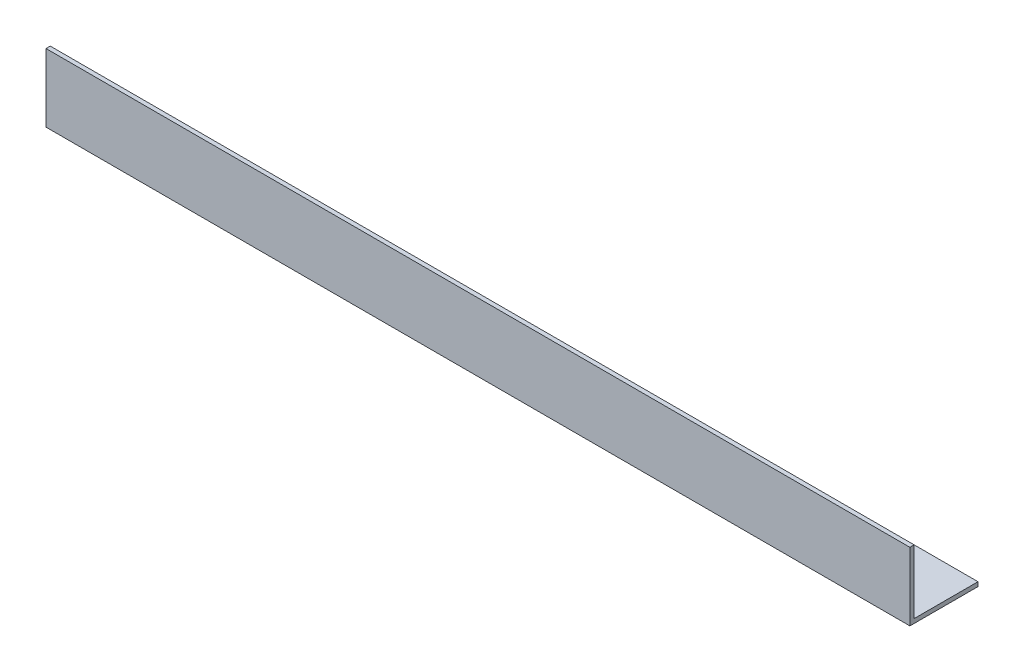
ISO-10303-21;
HEADER;
FILE_DESCRIPTION(('STEP AP214'),'2;1');
FILE_NAME('part.step','',(''),(''),'','','');
FILE_SCHEMA(('AUTOMOTIVE_DESIGN { 1 0 10303 214 1 1 1 1 }'));
ENDSEC;
DATA;
#1=APPLICATION_CONTEXT('core data for automotive mechanical design processes');
#2=APPLICATION_PROTOCOL_DEFINITION('international standard','automotive_design',2000,#1);
#3=PRODUCT_CONTEXT('',#1,'mechanical');
#4=PRODUCT('Part','Part','',(#3));
#5=PRODUCT_RELATED_PRODUCT_CATEGORY('part','',(#4));
#6=PRODUCT_DEFINITION_FORMATION('','',#4);
#7=PRODUCT_DEFINITION_CONTEXT('part definition',#1,'design');
#8=PRODUCT_DEFINITION('design','',#6,#7);
#9=PRODUCT_DEFINITION_SHAPE('','',#8);
#10=(LENGTH_UNIT() NAMED_UNIT(*) SI_UNIT(.MILLI.,.METRE.));
#11=(NAMED_UNIT(*) PLANE_ANGLE_UNIT() SI_UNIT($,.RADIAN.));
#12=(NAMED_UNIT(*) SI_UNIT($,.STERADIAN.) SOLID_ANGLE_UNIT());
#13=UNCERTAINTY_MEASURE_WITH_UNIT(LENGTH_MEASURE(1.E-05),#10,'distance_accuracy_value','');
#14=(GEOMETRIC_REPRESENTATION_CONTEXT(3) GLOBAL_UNCERTAINTY_ASSIGNED_CONTEXT((#13)) GLOBAL_UNIT_ASSIGNED_CONTEXT((#10,
#11,#12)) REPRESENTATION_CONTEXT('',''));
#15=CARTESIAN_POINT('',(0.,0.,0.));
#16=DIRECTION('',(0.,0.,1.));
#17=DIRECTION('',(1.,0.,0.));
#18=AXIS2_PLACEMENT_3D('',#15,#16,#17);
#19=CARTESIAN_POINT('',(203.,16.,-0.999999999999999));
#20=DIRECTION('',(0.,-1.,0.));
#21=DIRECTION('',(0.,0.,-1.));
#22=AXIS2_PLACEMENT_3D('',#19,#20,#21);
#23=PLANE('',#22);
#24=DIRECTION('',(0.,0.,1.));
#25=VECTOR('',#24,1.);
#26=CARTESIAN_POINT('',(0.,16.,-0.999999999999999));
#27=LINE('',#26,#25);
#28=CARTESIAN_POINT('',(0.,16.,-0.999999999999999));
#29=VERTEX_POINT('',#28);
#30=CARTESIAN_POINT('',(0.,16.,0.));
#31=VERTEX_POINT('',#30);
#32=EDGE_CURVE('E116',#29,#31,#27,.T.);
#33=ORIENTED_EDGE('',*,*,#32,.T.);
#34=DIRECTION('',(-1.,0.,0.));
#35=VECTOR('',#34,1.);
#36=CARTESIAN_POINT('',(203.,16.,0.));
#37=LINE('',#36,#35);
#38=CARTESIAN_POINT('',(203.,16.,0.));
#39=VERTEX_POINT('',#38);
#40=EDGE_CURVE('E11',#39,#31,#37,.T.);
#41=ORIENTED_EDGE('',*,*,#40,.F.);
#42=DIRECTION('',(0.,0.,1.));
#43=VECTOR('',#42,1.);
#44=CARTESIAN_POINT('',(203.,16.,-0.999999999999999));
#45=LINE('',#44,#43);
#46=CARTESIAN_POINT('',(203.,16.,-0.999999999999999));
#47=VERTEX_POINT('',#46);
#48=EDGE_CURVE('E126',#47,#39,#45,.T.);
#49=ORIENTED_EDGE('',*,*,#48,.F.);
#50=DIRECTION('',(-1.,0.,0.));
#51=VECTOR('',#50,1.);
#52=CARTESIAN_POINT('',(203.,16.,-0.999999999999999));
#53=LINE('',#52,#51);
#54=EDGE_CURVE('E112',#47,#29,#53,.T.);
#55=ORIENTED_EDGE('',*,*,#54,.T.);
#56=EDGE_LOOP('',(#33,#41,#49,#55));
#57=FACE_BOUND('',#56,.T.);
#58=ADVANCED_FACE('F32',(#57),#23,.F.);
#59=CARTESIAN_POINT('',(203.,16.,0.));
#60=DIRECTION('',(0.,0.,-1.));
#61=DIRECTION('',(0.,1.,0.));
#62=AXIS2_PLACEMENT_3D('',#59,#60,#61);
#63=PLANE('',#62);
#64=DIRECTION('',(0.,-1.,0.));
#65=VECTOR('',#64,1.);
#66=CARTESIAN_POINT('',(0.,16.,0.));
#67=LINE('',#66,#65);
#68=CARTESIAN_POINT('',(0.,0.,0.));
#69=VERTEX_POINT('',#68);
#70=EDGE_CURVE('E119',#31,#69,#67,.T.);
#71=ORIENTED_EDGE('',*,*,#70,.T.);
#72=DIRECTION('',(-1.,0.,0.));
#73=VECTOR('',#72,1.);
#74=CARTESIAN_POINT('',(203.,0.,0.));
#75=LINE('',#74,#73);
#76=CARTESIAN_POINT('',(203.,0.,0.));
#77=VERTEX_POINT('',#76);
#78=EDGE_CURVE('E40',#77,#69,#75,.T.);
#79=ORIENTED_EDGE('',*,*,#78,.F.);
#80=DIRECTION('',(0.,-1.,0.));
#81=VECTOR('',#80,1.);
#82=CARTESIAN_POINT('',(203.,16.,0.));
#83=LINE('',#82,#81);
#84=EDGE_CURVE('E85',#39,#77,#83,.T.);
#85=ORIENTED_EDGE('',*,*,#84,.F.);
#86=ORIENTED_EDGE('',*,*,#40,.T.);
#87=EDGE_LOOP('',(#71,#79,#85,#86));
#88=FACE_BOUND('',#87,.T.);
#89=ADVANCED_FACE('F150',(#88),#63,.F.);
#90=CARTESIAN_POINT('',(203.,0.,0.));
#91=DIRECTION('',(0.,1.,0.));
#92=DIRECTION('',(0.,0.,1.));
#93=AXIS2_PLACEMENT_3D('',#90,#91,#92);
#94=PLANE('',#93);
#95=DIRECTION('',(0.,0.,-1.));
#96=VECTOR('',#95,1.);
#97=CARTESIAN_POINT('',(0.,0.,0.));
#98=LINE('',#97,#96);
#99=CARTESIAN_POINT('',(0.,0.,-16.));
#100=VERTEX_POINT('',#99);
#101=EDGE_CURVE('E121',#69,#100,#98,.T.);
#102=ORIENTED_EDGE('',*,*,#101,.T.);
#103=DIRECTION('',(-1.,0.,0.));
#104=VECTOR('',#103,1.);
#105=CARTESIAN_POINT('',(203.,0.,-16.));
#106=LINE('',#105,#104);
#107=CARTESIAN_POINT('',(203.,0.,-16.));
#108=VERTEX_POINT('',#107);
#109=EDGE_CURVE('E107',#108,#100,#106,.T.);
#110=ORIENTED_EDGE('',*,*,#109,.F.);
#111=DIRECTION('',(0.,0.,-1.));
#112=VECTOR('',#111,1.);
#113=CARTESIAN_POINT('',(203.,0.,0.));
#114=LINE('',#113,#112);
#115=EDGE_CURVE('E98',#77,#108,#114,.T.);
#116=ORIENTED_EDGE('',*,*,#115,.F.);
#117=ORIENTED_EDGE('',*,*,#78,.T.);
#118=EDGE_LOOP('',(#102,#110,#116,#117));
#119=FACE_BOUND('',#118,.T.);
#120=ADVANCED_FACE('F132',(#119),#94,.F.);
#121=CARTESIAN_POINT('',(203.,0.,-16.));
#122=DIRECTION('',(0.,0.,1.));
#123=DIRECTION('',(1.,0.,0.));
#124=AXIS2_PLACEMENT_3D('',#121,#122,#123);
#125=PLANE('',#124);
#126=DIRECTION('',(0.,1.,0.));
#127=VECTOR('',#126,1.);
#128=CARTESIAN_POINT('',(0.,0.,-16.));
#129=LINE('',#128,#127);
#130=CARTESIAN_POINT('',(0.,1.,-16.));
#131=VERTEX_POINT('',#130);
#132=EDGE_CURVE('E106',#100,#131,#129,.T.);
#133=ORIENTED_EDGE('',*,*,#132,.T.);
#134=DIRECTION('',(-1.,0.,0.));
#135=VECTOR('',#134,1.);
#136=CARTESIAN_POINT('',(203.,1.,-16.));
#137=LINE('',#136,#135);
#138=CARTESIAN_POINT('',(203.,1.,-16.));
#139=VERTEX_POINT('',#138);
#140=EDGE_CURVE('E103',#139,#131,#137,.T.);
#141=ORIENTED_EDGE('',*,*,#140,.F.);
#142=DIRECTION('',(0.,1.,0.));
#143=VECTOR('',#142,1.);
#144=CARTESIAN_POINT('',(203.,0.,-16.));
#145=LINE('',#144,#143);
#146=EDGE_CURVE('E92',#108,#139,#145,.T.);
#147=ORIENTED_EDGE('',*,*,#146,.F.);
#148=ORIENTED_EDGE('',*,*,#109,.T.);
#149=EDGE_LOOP('',(#133,#141,#147,#148));
#150=FACE_BOUND('',#149,.T.);
#151=ADVANCED_FACE('F104',(#150),#125,.F.);
#152=CARTESIAN_POINT('',(203.,1.,-16.));
#153=DIRECTION('',(0.,-1.,0.));
#154=DIRECTION('',(0.,0.,-1.));
#155=AXIS2_PLACEMENT_3D('',#152,#153,#154);
#156=PLANE('',#155);
#157=DIRECTION('',(0.,0.,1.));
#158=VECTOR('',#157,1.);
#159=CARTESIAN_POINT('',(0.,1.,-16.));
#160=LINE('',#159,#158);
#161=CARTESIAN_POINT('',(0.,0.999999999999998,-1.));
#162=VERTEX_POINT('',#161);
#163=EDGE_CURVE('E71',#131,#162,#160,.T.);
#164=ORIENTED_EDGE('',*,*,#163,.T.);
#165=DIRECTION('',(-1.,0.,0.));
#166=VECTOR('',#165,1.);
#167=CARTESIAN_POINT('',(203.,0.999999999999998,-1.));
#168=LINE('',#167,#166);
#169=CARTESIAN_POINT('',(203.,0.999999999999998,-1.));
#170=VERTEX_POINT('',#169);
#171=EDGE_CURVE('E108',#170,#162,#168,.T.);
#172=ORIENTED_EDGE('',*,*,#171,.F.);
#173=DIRECTION('',(0.,0.,1.));
#174=VECTOR('',#173,1.);
#175=CARTESIAN_POINT('',(203.,1.,-16.));
#176=LINE('',#175,#174);
#177=EDGE_CURVE('E96',#139,#170,#176,.T.);
#178=ORIENTED_EDGE('',*,*,#177,.F.);
#179=ORIENTED_EDGE('',*,*,#140,.T.);
#180=EDGE_LOOP('',(#164,#172,#178,#179));
#181=FACE_BOUND('',#180,.T.);
#182=ADVANCED_FACE('F110',(#181),#156,.F.);
#183=CARTESIAN_POINT('',(203.,0.999999999999998,-1.));
#184=DIRECTION('',(0.,0.,1.));
#185=DIRECTION('',(0.,-1.,0.));
#186=AXIS2_PLACEMENT_3D('',#183,#184,#185);
#187=PLANE('',#186);
#188=DIRECTION('',(0.,1.,0.));
#189=VECTOR('',#188,1.);
#190=CARTESIAN_POINT('',(0.,0.999999999999998,-1.));
#191=LINE('',#190,#189);
#192=EDGE_CURVE('E77',#162,#29,#191,.T.);
#193=ORIENTED_EDGE('',*,*,#192,.T.);
#194=ORIENTED_EDGE('',*,*,#54,.F.);
#195=DIRECTION('',(0.,1.,0.));
#196=VECTOR('',#195,1.);
#197=CARTESIAN_POINT('',(203.,0.999999999999998,-1.));
#198=LINE('',#197,#196);
#199=EDGE_CURVE('E48',#170,#47,#198,.T.);
#200=ORIENTED_EDGE('',*,*,#199,.F.);
#201=ORIENTED_EDGE('',*,*,#171,.T.);
#202=EDGE_LOOP('',(#193,#194,#200,#201));
#203=FACE_BOUND('',#202,.T.);
#204=ADVANCED_FACE('F139',(#203),#187,.F.);
#205=CARTESIAN_POINT('',(203.,0.,0.));
#206=DIRECTION('',(1.,0.,0.));
#207=DIRECTION('',(0.,0.,-1.));
#208=AXIS2_PLACEMENT_3D('',#205,#206,#207);
#209=PLANE('',#208);
#210=ORIENTED_EDGE('',*,*,#48,.T.);
#211=ORIENTED_EDGE('',*,*,#84,.T.);
#212=ORIENTED_EDGE('',*,*,#115,.T.);
#213=ORIENTED_EDGE('',*,*,#146,.T.);
#214=ORIENTED_EDGE('',*,*,#177,.T.);
#215=ORIENTED_EDGE('',*,*,#199,.T.);
#216=EDGE_LOOP('',(#210,#211,#212,#213,#214,#215));
#217=FACE_BOUND('',#216,.T.);
#218=ADVANCED_FACE('F94',(#217),#209,.T.);
#219=CARTESIAN_POINT('',(0.,0.,0.));
#220=DIRECTION('',(1.,0.,0.));
#221=DIRECTION('',(0.,0.,-1.));
#222=AXIS2_PLACEMENT_3D('',#219,#220,#221);
#223=PLANE('',#222);
#224=ORIENTED_EDGE('',*,*,#32,.F.);
#225=ORIENTED_EDGE('',*,*,#192,.F.);
#226=ORIENTED_EDGE('',*,*,#163,.F.);
#227=ORIENTED_EDGE('',*,*,#132,.F.);
#228=ORIENTED_EDGE('',*,*,#101,.F.);
#229=ORIENTED_EDGE('',*,*,#70,.F.);
#230=EDGE_LOOP('',(#224,#225,#226,#227,#228,#229));
#231=FACE_BOUND('',#230,.T.);
#232=ADVANCED_FACE('F135',(#231),#223,.F.);
#233=CLOSED_SHELL('',(#58,#89,#120,#151,#182,#204,#218,#232));
#234=MANIFOLD_SOLID_BREP('B2',#233);
#235=ADVANCED_BREP_SHAPE_REPRESENTATION('',(#18,#234),#14);
#236=SHAPE_DEFINITION_REPRESENTATION(#9,#235);
ENDSEC;
END-ISO-10303-21;
